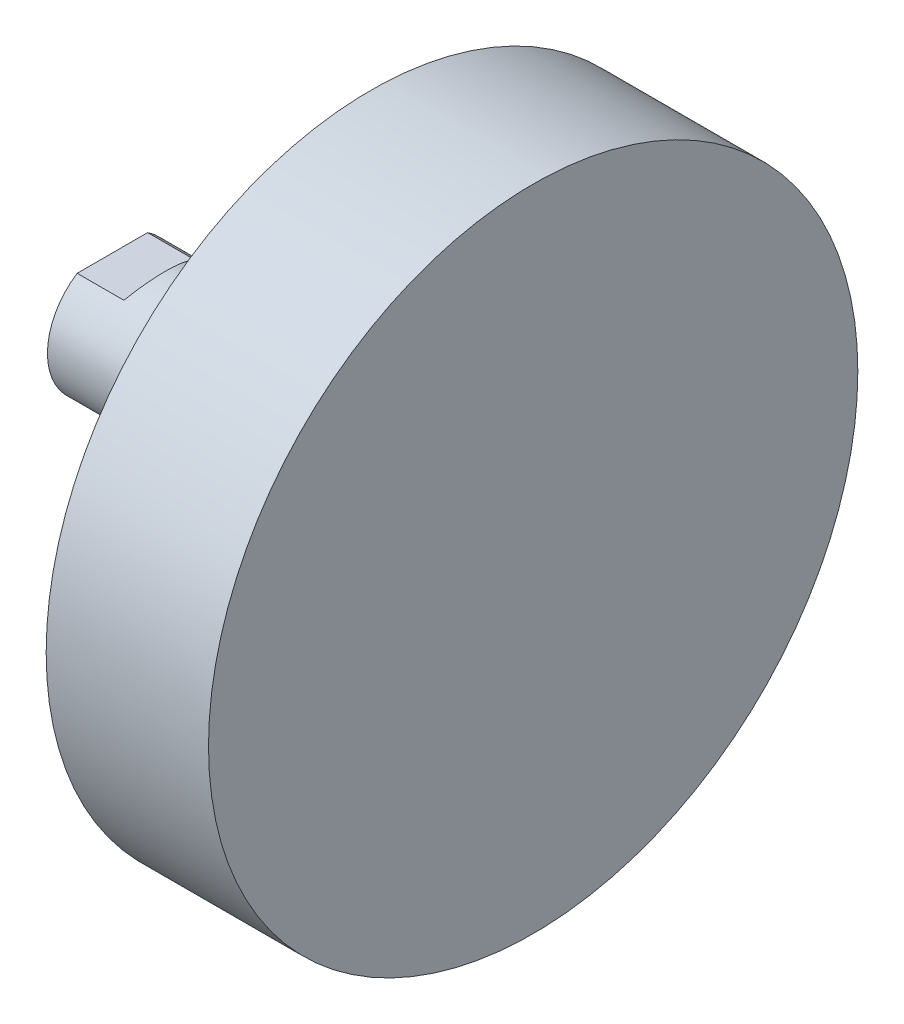
ISO-10303-21;
HEADER;
FILE_DESCRIPTION(('STEP AP214'),'2;1');
FILE_NAME('part.step','',(''),(''),'','','');
FILE_SCHEMA(('AUTOMOTIVE_DESIGN { 1 0 10303 214 1 1 1 1 }'));
ENDSEC;
DATA;
#1=APPLICATION_CONTEXT('core data for automotive mechanical design processes');
#2=APPLICATION_PROTOCOL_DEFINITION('international standard','automotive_design',2000,#1);
#3=PRODUCT_CONTEXT('',#1,'mechanical');
#4=PRODUCT('Part','Part','',(#3));
#5=PRODUCT_RELATED_PRODUCT_CATEGORY('part','',(#4));
#6=PRODUCT_DEFINITION_FORMATION('','',#4);
#7=PRODUCT_DEFINITION_CONTEXT('part definition',#1,'design');
#8=PRODUCT_DEFINITION('design','',#6,#7);
#9=PRODUCT_DEFINITION_SHAPE('','',#8);
#10=(LENGTH_UNIT() NAMED_UNIT(*) SI_UNIT(.MILLI.,.METRE.));
#11=(NAMED_UNIT(*) PLANE_ANGLE_UNIT() SI_UNIT($,.RADIAN.));
#12=(NAMED_UNIT(*) SI_UNIT($,.STERADIAN.) SOLID_ANGLE_UNIT());
#13=UNCERTAINTY_MEASURE_WITH_UNIT(LENGTH_MEASURE(1.E-05),#10,'distance_accuracy_value','');
#14=(GEOMETRIC_REPRESENTATION_CONTEXT(3) GLOBAL_UNCERTAINTY_ASSIGNED_CONTEXT((#13)) GLOBAL_UNIT_ASSIGNED_CONTEXT((#10,
#11,#12)) REPRESENTATION_CONTEXT('',''));
#15=CARTESIAN_POINT('',(0.,0.,0.));
#16=DIRECTION('',(0.,0.,1.));
#17=DIRECTION('',(1.,0.,0.));
#18=AXIS2_PLACEMENT_3D('',#15,#16,#17);
#19=CARTESIAN_POINT('',(70.,0.,0.));
#20=DIRECTION('',(-1.,0.,0.));
#21=DIRECTION('',(0.,0.,1.));
#22=AXIS2_PLACEMENT_3D('',#19,#20,#21);
#23=CYLINDRICAL_SURFACE('',#22,12.5);
#24=CARTESIAN_POINT('',(38.75,0.,0.));
#25=DIRECTION('',(1.,0.,0.));
#26=DIRECTION('',(0.,0.,-1.));
#27=AXIS2_PLACEMENT_3D('',#24,#25,#26);
#28=CIRCLE('',#27,12.5);
#29=CARTESIAN_POINT('',(38.75,0.,-12.5));
#30=VERTEX_POINT('',#29);
#31=EDGE_CURVE('E187',#30,#30,#28,.T.);
#32=ORIENTED_EDGE('',*,*,#31,.F.);
#33=EDGE_LOOP('',(#32));
#34=FACE_BOUND('',#33,.T.);
#35=DIRECTION('',(-1.,0.,0.));
#36=VECTOR('',#35,1.);
#37=CARTESIAN_POINT('',(70.,-10.5,6.78232998312527));
#38=LINE('',#37,#36);
#39=CARTESIAN_POINT('',(-2.,-10.5,6.78232998312527));
#40=VERTEX_POINT('',#39);
#41=CARTESIAN_POINT('',(-11.,-10.5,6.78232998312527));
#42=VERTEX_POINT('',#41);
#43=EDGE_CURVE('E54',#40,#42,#38,.T.);
#44=ORIENTED_EDGE('',*,*,#43,.F.);
#45=CARTESIAN_POINT('',(-8.0621778264911,0.,0.));
#46=DIRECTION('',(-0.866025403784438,-0.500000000000002,0.));
#47=DIRECTION('',(-0.500000000000002,0.866025403784438,0.));
#48=AXIS2_PLACEMENT_3D('',#45,#46,#47);
#49=ELLIPSE('',#48,14.4337567297407,12.5);
#50=CARTESIAN_POINT('',(-2.,-10.5,-6.78232998312527));
#51=VERTEX_POINT('',#50);
#52=EDGE_CURVE('E11',#51,#40,#49,.T.);
#53=ORIENTED_EDGE('',*,*,#52,.F.);
#54=DIRECTION('',(-1.,0.,0.));
#55=VECTOR('',#54,1.);
#56=CARTESIAN_POINT('',(70.,-10.5,-6.78232998312527));
#57=LINE('',#56,#55);
#58=CARTESIAN_POINT('',(-11.,-10.5,-6.78232998312527));
#59=VERTEX_POINT('',#58);
#60=EDGE_CURVE('E174',#59,#51,#57,.F.);
#61=ORIENTED_EDGE('',*,*,#60,.F.);
#62=CARTESIAN_POINT('',(-11.,0.,0.));
#63=DIRECTION('',(-1.,0.,0.));
#64=DIRECTION('',(0.,0.,1.));
#65=AXIS2_PLACEMENT_3D('',#62,#63,#64);
#66=CIRCLE('',#65,12.5);
#67=CARTESIAN_POINT('',(-11.,10.5,-6.78232998312527));
#68=VERTEX_POINT('',#67);
#69=EDGE_CURVE('E186',#68,#59,#66,.T.);
#70=ORIENTED_EDGE('',*,*,#69,.F.);
#71=DIRECTION('',(-1.,0.,0.));
#72=VECTOR('',#71,1.);
#73=CARTESIAN_POINT('',(70.,10.5,-6.78232998312527));
#74=LINE('',#73,#72);
#75=CARTESIAN_POINT('',(-2.,10.5,-6.78232998312525));
#76=VERTEX_POINT('',#75);
#77=EDGE_CURVE('E62',#76,#68,#74,.T.);
#78=ORIENTED_EDGE('',*,*,#77,.F.);
#79=CARTESIAN_POINT('',(-8.06217782649105,0.,0.));
#80=DIRECTION('',(-0.86602540378444,0.499999999999998,0.));
#81=DIRECTION('',(-0.499999999999998,-0.86602540378444,0.));
#82=AXIS2_PLACEMENT_3D('',#79,#80,#81);
#83=ELLIPSE('',#82,14.4337567297406,12.5);
#84=CARTESIAN_POINT('',(-2.,10.5,6.78232998312527));
#85=VERTEX_POINT('',#84);
#86=EDGE_CURVE('E47',#85,#76,#83,.T.);
#87=ORIENTED_EDGE('',*,*,#86,.F.);
#88=DIRECTION('',(-1.,0.,0.));
#89=VECTOR('',#88,1.);
#90=CARTESIAN_POINT('',(70.,10.5,6.78232998312527));
#91=LINE('',#90,#89);
#92=CARTESIAN_POINT('',(-11.,10.5,6.78232998312527));
#93=VERTEX_POINT('',#92);
#94=EDGE_CURVE('E171',#93,#85,#91,.F.);
#95=ORIENTED_EDGE('',*,*,#94,.F.);
#96=EDGE_CURVE('E183',#42,#93,#66,.T.);
#97=ORIENTED_EDGE('',*,*,#96,.F.);
#98=EDGE_LOOP('',(#44,#53,#61,#70,#78,#87,#95,#97));
#99=FACE_BOUND('',#98,.T.);
#100=ADVANCED_FACE('F39',(#34,#99),#23,.T.);
#101=CARTESIAN_POINT('',(-11.,0.,0.));
#102=DIRECTION('',(1.,0.,0.));
#103=DIRECTION('',(0.,0.,-1.));
#104=AXIS2_PLACEMENT_3D('',#101,#102,#103);
#105=PLANE('',#104);
#106=CARTESIAN_POINT('',(-11.,0.,0.));
#107=DIRECTION('',(-1.,0.,0.));
#108=DIRECTION('',(0.,0.,1.));
#109=AXIS2_PLACEMENT_3D('',#106,#107,#108);
#110=CIRCLE('',#109,9.5);
#111=CARTESIAN_POINT('',(-11.,0.,9.5));
#112=VERTEX_POINT('',#111);
#113=EDGE_CURVE('E163',#112,#112,#110,.T.);
#114=ORIENTED_EDGE('',*,*,#113,.F.);
#115=EDGE_LOOP('',(#114));
#116=FACE_BOUND('',#115,.T.);
#117=DIRECTION('',(0.,0.,-1.));
#118=VECTOR('',#117,1.);
#119=CARTESIAN_POINT('',(-11.,-10.5,0.));
#120=LINE('',#119,#118);
#121=EDGE_CURVE('E192',#42,#59,#120,.T.);
#122=ORIENTED_EDGE('',*,*,#121,.F.);
#123=ORIENTED_EDGE('',*,*,#96,.T.);
#124=DIRECTION('',(0.,0.,1.));
#125=VECTOR('',#124,1.);
#126=CARTESIAN_POINT('',(-11.,10.5,0.));
#127=LINE('',#126,#125);
#128=EDGE_CURVE('E190',#68,#93,#127,.T.);
#129=ORIENTED_EDGE('',*,*,#128,.F.);
#130=ORIENTED_EDGE('',*,*,#69,.T.);
#131=EDGE_LOOP('',(#122,#123,#129,#130));
#132=FACE_BOUND('',#131,.T.);
#133=ADVANCED_FACE('F41',(#116,#132),#105,.F.);
#134=CARTESIAN_POINT('',(38.75,0.,0.));
#135=DIRECTION('',(1.,0.,0.));
#136=DIRECTION('',(0.,0.,-1.));
#137=AXIS2_PLACEMENT_3D('',#134,#135,#136);
#138=PLANE('',#137);
#139=ORIENTED_EDGE('',*,*,#31,.T.);
#140=EDGE_LOOP('',(#139));
#141=FACE_BOUND('',#140,.T.);
#142=CARTESIAN_POINT('',(38.75,0.,0.));
#143=DIRECTION('',(-1.,0.,0.));
#144=DIRECTION('',(0.,0.,1.));
#145=AXIS2_PLACEMENT_3D('',#142,#143,#144);
#146=CIRCLE('',#145,62.5);
#147=CARTESIAN_POINT('',(38.75,0.,62.5));
#148=VERTEX_POINT('',#147);
#149=EDGE_CURVE('E180',#148,#148,#146,.T.);
#150=ORIENTED_EDGE('',*,*,#149,.T.);
#151=EDGE_LOOP('',(#150));
#152=FACE_BOUND('',#151,.T.);
#153=ADVANCED_FACE('F99',(#141,#152),#138,.F.);
#154=CARTESIAN_POINT('',(70.,0.,0.));
#155=DIRECTION('',(-1.,0.,0.));
#156=DIRECTION('',(0.,0.,1.));
#157=AXIS2_PLACEMENT_3D('',#154,#155,#156);
#158=CYLINDRICAL_SURFACE('',#157,62.5);
#159=ORIENTED_EDGE('',*,*,#149,.F.);
#160=EDGE_LOOP('',(#159));
#161=FACE_BOUND('',#160,.T.);
#162=CARTESIAN_POINT('',(70.,0.,0.));
#163=DIRECTION('',(-1.,0.,0.));
#164=DIRECTION('',(0.,0.,1.));
#165=AXIS2_PLACEMENT_3D('',#162,#163,#164);
#166=CIRCLE('',#165,62.5);
#167=CARTESIAN_POINT('',(70.,0.,62.5));
#168=VERTEX_POINT('',#167);
#169=EDGE_CURVE('E177',#168,#168,#166,.T.);
#170=ORIENTED_EDGE('',*,*,#169,.T.);
#171=EDGE_LOOP('',(#170));
#172=FACE_BOUND('',#171,.T.);
#173=ADVANCED_FACE('F108',(#161,#172),#158,.T.);
#174=CARTESIAN_POINT('',(70.,12.5,0.));
#175=DIRECTION('',(-1.,0.,0.));
#176=DIRECTION('',(0.,0.,1.));
#177=AXIS2_PLACEMENT_3D('',#174,#175,#176);
#178=PLANE('',#177);
#179=ORIENTED_EDGE('',*,*,#169,.F.);
#180=EDGE_LOOP('',(#179));
#181=FACE_BOUND('',#180,.T.);
#182=ADVANCED_FACE('F104',(#181),#178,.F.);
#183=CARTESIAN_POINT('',(-11.,10.5,25.));
#184=DIRECTION('',(0.,1.,0.));
#185=DIRECTION('',(0.,0.,1.));
#186=AXIS2_PLACEMENT_3D('',#183,#184,#185);
#187=PLANE('',#186);
#188=ORIENTED_EDGE('',*,*,#77,.T.);
#189=ORIENTED_EDGE('',*,*,#128,.T.);
#190=ORIENTED_EDGE('',*,*,#94,.T.);
#191=DIRECTION('',(0.,0.,-1.));
#192=VECTOR('',#191,1.);
#193=CARTESIAN_POINT('',(-2.,10.5,25.));
#194=LINE('',#193,#192);
#195=EDGE_CURVE('E166',#85,#76,#194,.T.);
#196=ORIENTED_EDGE('',*,*,#195,.T.);
#197=EDGE_LOOP('',(#188,#189,#190,#196));
#198=FACE_BOUND('',#197,.T.);
#199=ADVANCED_FACE('F107',(#198),#187,.T.);
#200=CARTESIAN_POINT('',(-2.,10.5,25.));
#201=DIRECTION('',(-0.86602540378444,0.499999999999998,0.));
#202=DIRECTION('',(-0.499999999999998,-0.86602540378444,0.));
#203=AXIS2_PLACEMENT_3D('',#200,#201,#202);
#204=PLANE('',#203);
#205=ORIENTED_EDGE('',*,*,#86,.T.);
#206=ORIENTED_EDGE('',*,*,#195,.F.);
#207=EDGE_LOOP('',(#205,#206));
#208=FACE_BOUND('',#207,.T.);
#209=ADVANCED_FACE('F120',(#208),#204,.T.);
#210=CARTESIAN_POINT('',(8.1036297108185,-28.,25.));
#211=DIRECTION('',(-0.866025403784438,-0.500000000000002,0.));
#212=DIRECTION('',(0.500000000000002,-0.866025403784438,0.));
#213=AXIS2_PLACEMENT_3D('',#210,#211,#212);
#214=PLANE('',#213);
#215=ORIENTED_EDGE('',*,*,#52,.T.);
#216=DIRECTION('',(0.,0.,-1.));
#217=VECTOR('',#216,1.);
#218=CARTESIAN_POINT('',(-2.,-10.5,25.));
#219=LINE('',#218,#217);
#220=EDGE_CURVE('E168',#40,#51,#219,.T.);
#221=ORIENTED_EDGE('',*,*,#220,.T.);
#222=EDGE_LOOP('',(#215,#221));
#223=FACE_BOUND('',#222,.T.);
#224=ADVANCED_FACE('F116',(#223),#214,.T.);
#225=CARTESIAN_POINT('',(-2.,-10.5,25.));
#226=DIRECTION('',(0.,-1.,0.));
#227=DIRECTION('',(0.,0.,-1.));
#228=AXIS2_PLACEMENT_3D('',#225,#226,#227);
#229=PLANE('',#228);
#230=ORIENTED_EDGE('',*,*,#43,.T.);
#231=ORIENTED_EDGE('',*,*,#121,.T.);
#232=ORIENTED_EDGE('',*,*,#60,.T.);
#233=ORIENTED_EDGE('',*,*,#220,.F.);
#234=EDGE_LOOP('',(#230,#231,#232,#233));
#235=FACE_BOUND('',#234,.T.);
#236=ADVANCED_FACE('F119',(#235),#229,.T.);
#237=CARTESIAN_POINT('',(-10.,0.,0.));
#238=DIRECTION('',(-1.,0.,0.));
#239=DIRECTION('',(0.,0.,1.));
#240=AXIS2_PLACEMENT_3D('',#237,#238,#239);
#241=CONICAL_SURFACE('',#240,8.5,0.785398163397447);
#242=ORIENTED_EDGE('',*,*,#113,.T.);
#243=EDGE_LOOP('',(#242));
#244=FACE_BOUND('',#243,.T.);
#245=CARTESIAN_POINT('',(-10.,0.,0.));
#246=DIRECTION('',(-1.,0.,0.));
#247=DIRECTION('',(0.,0.,1.));
#248=AXIS2_PLACEMENT_3D('',#245,#246,#247);
#249=CIRCLE('',#248,8.5);
#250=CARTESIAN_POINT('',(-10.,0.,8.5));
#251=VERTEX_POINT('',#250);
#252=EDGE_CURVE('E160',#251,#251,#249,.T.);
#253=ORIENTED_EDGE('',*,*,#252,.F.);
#254=EDGE_LOOP('',(#253));
#255=FACE_BOUND('',#254,.T.);
#256=ADVANCED_FACE('F124',(#244,#255),#241,.F.);
#257=CARTESIAN_POINT('',(24.493820487119,0.,0.));
#258=DIRECTION('',(-1.,0.,0.));
#259=DIRECTION('',(0.,0.,1.));
#260=AXIS2_PLACEMENT_3D('',#257,#258,#259);
#261=CYLINDRICAL_SURFACE('',#260,8.5);
#262=ORIENTED_EDGE('',*,*,#252,.T.);
#263=EDGE_LOOP('',(#262));
#264=FACE_BOUND('',#263,.T.);
#265=CARTESIAN_POINT('',(-4.,0.,0.));
#266=DIRECTION('',(-1.,0.,0.));
#267=DIRECTION('',(0.,0.,1.));
#268=AXIS2_PLACEMENT_3D('',#265,#266,#267);
#269=CIRCLE('',#268,8.5);
#270=CARTESIAN_POINT('',(-4.,0.,8.5));
#271=VERTEX_POINT('',#270);
#272=EDGE_CURVE('E154',#271,#271,#269,.T.);
#273=ORIENTED_EDGE('',*,*,#272,.F.);
#274=EDGE_LOOP('',(#273));
#275=FACE_BOUND('',#274,.T.);
#276=ADVANCED_FACE('F132',(#264,#275),#261,.F.);
#277=CARTESIAN_POINT('',(-4.,8.5,0.));
#278=DIRECTION('',(-1.,0.,0.));
#279=DIRECTION('',(0.,0.,1.));
#280=AXIS2_PLACEMENT_3D('',#277,#278,#279);
#281=PLANE('',#280);
#282=ORIENTED_EDGE('',*,*,#272,.T.);
#283=EDGE_LOOP('',(#282));
#284=FACE_BOUND('',#283,.T.);
#285=CARTESIAN_POINT('',(-4.,0.,0.));
#286=DIRECTION('',(-1.,0.,0.));
#287=DIRECTION('',(0.,0.,1.));
#288=AXIS2_PLACEMENT_3D('',#285,#286,#287);
#289=CIRCLE('',#288,8.);
#290=CARTESIAN_POINT('',(-4.,0.,8.));
#291=VERTEX_POINT('',#290);
#292=EDGE_CURVE('E148',#291,#291,#289,.T.);
#293=ORIENTED_EDGE('',*,*,#292,.F.);
#294=EDGE_LOOP('',(#293));
#295=FACE_BOUND('',#294,.T.);
#296=ADVANCED_FACE('F136',(#284,#295),#281,.T.);
#297=CARTESIAN_POINT('',(-2.9175,0.,0.));
#298=DIRECTION('',(-1.,0.,0.));
#299=DIRECTION('',(0.,0.,1.));
#300=AXIS2_PLACEMENT_3D('',#297,#298,#299);
#301=CONICAL_SURFACE('',#300,6.9175,0.785398163397448);
#302=ORIENTED_EDGE('',*,*,#292,.T.);
#303=EDGE_LOOP('',(#302));
#304=FACE_BOUND('',#303,.T.);
#305=CARTESIAN_POINT('',(-2.9175,0.,0.));
#306=DIRECTION('',(-1.,0.,0.));
#307=DIRECTION('',(0.,0.,1.));
#308=AXIS2_PLACEMENT_3D('',#305,#306,#307);
#309=CIRCLE('',#308,6.9175);
#310=CARTESIAN_POINT('',(-2.9175,0.,6.9175));
#311=VERTEX_POINT('',#310);
#312=EDGE_CURVE('E151',#311,#311,#309,.T.);
#313=ORIENTED_EDGE('',*,*,#312,.F.);
#314=EDGE_LOOP('',(#313));
#315=FACE_BOUND('',#314,.T.);
#316=ADVANCED_FACE('F90',(#304,#315),#301,.F.);
#317=CARTESIAN_POINT('',(24.493820487119,0.,0.));
#318=DIRECTION('',(-1.,0.,0.));
#319=DIRECTION('',(0.,0.,1.));
#320=AXIS2_PLACEMENT_3D('',#317,#318,#319);
#321=CYLINDRICAL_SURFACE('',#320,6.9175);
#322=ORIENTED_EDGE('',*,*,#312,.T.);
#323=EDGE_LOOP('',(#322));
#324=FACE_BOUND('',#323,.T.);
#325=CARTESIAN_POINT('',(20.5,0.,0.));
#326=DIRECTION('',(-1.,0.,0.));
#327=DIRECTION('',(0.,0.,1.));
#328=AXIS2_PLACEMENT_3D('',#325,#326,#327);
#329=CIRCLE('',#328,6.9175);
#330=CARTESIAN_POINT('',(20.5,0.,6.9175));
#331=VERTEX_POINT('',#330);
#332=EDGE_CURVE('E152',#331,#331,#329,.T.);
#333=ORIENTED_EDGE('',*,*,#332,.F.);
#334=EDGE_LOOP('',(#333));
#335=FACE_BOUND('',#334,.T.);
#336=ADVANCED_FACE('F84',(#324,#335),#321,.F.);
#337=CARTESIAN_POINT('',(24.493820487119,0.,0.));
#338=DIRECTION('',(-1.,0.,0.));
#339=DIRECTION('',(0.,0.,1.));
#340=AXIS2_PLACEMENT_3D('',#337,#338,#339);
#341=CONICAL_SURFACE('',#340,0.,1.04719755119662);
#342=ORIENTED_EDGE('',*,*,#332,.T.);
#343=EDGE_LOOP('',(#342));
#344=FACE_BOUND('',#343,.T.);
#345=CARTESIAN_POINT('',(24.493820487119,0.,0.));
#346=VERTEX_POINT('',#345);
#347=VERTEX_LOOP('',#346);
#348=FACE_BOUND('',#347,.T.);
#349=ADVANCED_FACE('F82',(#344,#348),#341,.F.);
#350=CLOSED_SHELL('',(#100,#133,#153,#173,#182,#199,#209,#224,#236,#256,#276,#296,#316,#336,#349));
#351=MANIFOLD_SOLID_BREP('B2',#350);
#352=ADVANCED_BREP_SHAPE_REPRESENTATION('',(#18,#351),#14);
#353=SHAPE_DEFINITION_REPRESENTATION(#9,#352);
ENDSEC;
END-ISO-10303-21;
